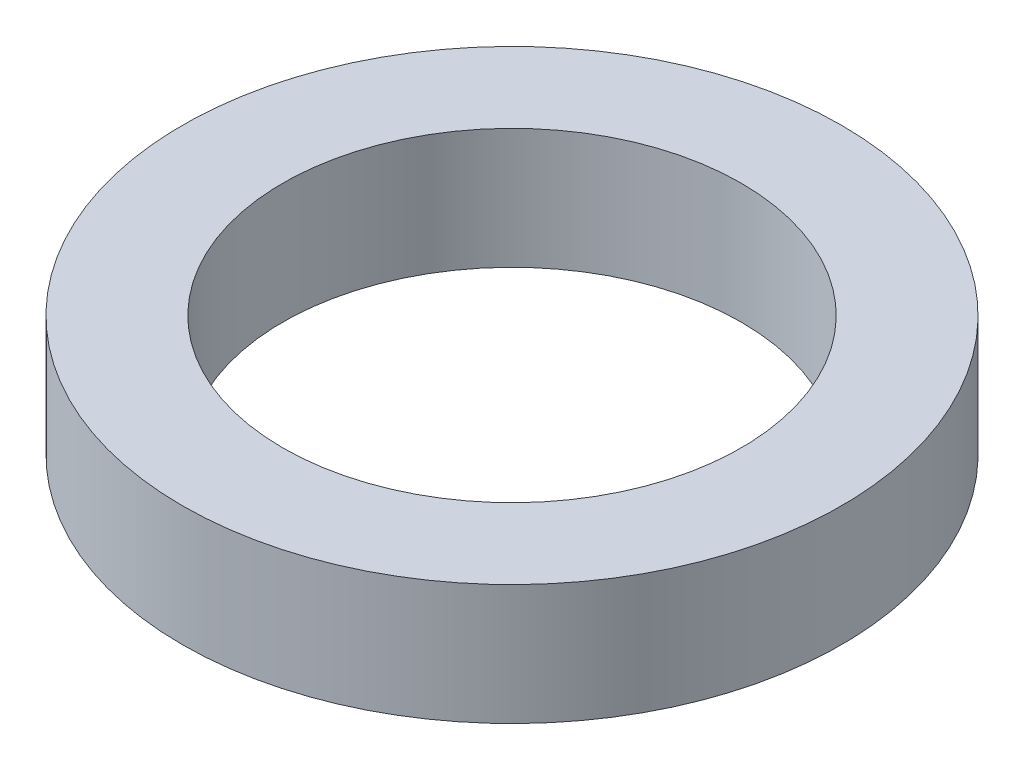
ISO-10303-21;
HEADER;
FILE_DESCRIPTION(('STEP AP214'),'2;1');
FILE_NAME('part.step','',(''),(''),'','','');
FILE_SCHEMA(('AUTOMOTIVE_DESIGN { 1 0 10303 214 1 1 1 1 }'));
ENDSEC;
DATA;
#1=APPLICATION_CONTEXT('core data for automotive mechanical design processes');
#2=APPLICATION_PROTOCOL_DEFINITION('international standard','automotive_design',2000,#1);
#3=PRODUCT_CONTEXT('',#1,'mechanical');
#4=PRODUCT('Part','Part','',(#3));
#5=PRODUCT_RELATED_PRODUCT_CATEGORY('part','',(#4));
#6=PRODUCT_DEFINITION_FORMATION('','',#4);
#7=PRODUCT_DEFINITION_CONTEXT('part definition',#1,'design');
#8=PRODUCT_DEFINITION('design','',#6,#7);
#9=PRODUCT_DEFINITION_SHAPE('','',#8);
#10=(LENGTH_UNIT() NAMED_UNIT(*) SI_UNIT(.MILLI.,.METRE.));
#11=(NAMED_UNIT(*) PLANE_ANGLE_UNIT() SI_UNIT($,.RADIAN.));
#12=(NAMED_UNIT(*) SI_UNIT($,.STERADIAN.) SOLID_ANGLE_UNIT());
#13=UNCERTAINTY_MEASURE_WITH_UNIT(LENGTH_MEASURE(1.E-05),#10,'distance_accuracy_value','');
#14=(GEOMETRIC_REPRESENTATION_CONTEXT(3) GLOBAL_UNCERTAINTY_ASSIGNED_CONTEXT((#13)) GLOBAL_UNIT_ASSIGNED_CONTEXT((#10,
#11,#12)) REPRESENTATION_CONTEXT('',''));
#15=CARTESIAN_POINT('',(0.,0.,0.));
#16=DIRECTION('',(0.,0.,1.));
#17=DIRECTION('',(1.,0.,0.));
#18=AXIS2_PLACEMENT_3D('',#15,#16,#17);
#19=CARTESIAN_POINT('',(0.,21.,0.));
#20=DIRECTION('',(0.,-1.,0.));
#21=DIRECTION('',(0.,0.,-1.));
#22=AXIS2_PLACEMENT_3D('',#19,#20,#21);
#23=CYLINDRICAL_SURFACE('',#22,57.5);
#24=CARTESIAN_POINT('',(0.,21.,0.));
#25=DIRECTION('',(0.,1.,0.));
#26=DIRECTION('',(0.,0.,1.));
#27=AXIS2_PLACEMENT_3D('',#24,#25,#26);
#28=CIRCLE('',#27,57.5);
#29=CARTESIAN_POINT('',(0.,21.,-57.5));
#30=VERTEX_POINT('',#29);
#31=EDGE_CURVE('E10',#30,#30,#28,.T.);
#32=CARTESIAN_POINT('',(0.,0.,0.));
#33=DIRECTION('',(0.,1.,0.));
#34=DIRECTION('',(0.,0.,1.));
#35=AXIS2_PLACEMENT_3D('',#32,#33,#34);
#36=CIRCLE('',#35,57.5);
#37=CARTESIAN_POINT('',(0.,0.,-57.5));
#38=VERTEX_POINT('',#37);
#39=EDGE_CURVE('E37',#38,#38,#36,.T.);
#40=CARTESIAN_POINT('',(0.,21.,-57.5));
#41=CARTESIAN_POINT('',(0.,20.78125,-57.5));
#42=CARTESIAN_POINT('',(0.,20.5625,-57.5));
#43=CARTESIAN_POINT('',(0.,20.125,-57.5));
#44=CARTESIAN_POINT('',(0.,19.90625,-57.5));
#45=CARTESIAN_POINT('',(0.,19.46875,-57.5));
#46=CARTESIAN_POINT('',(0.,19.25,-57.5));
#47=CARTESIAN_POINT('',(0.,18.8125,-57.5));
#48=CARTESIAN_POINT('',(0.,18.59375,-57.5));
#49=CARTESIAN_POINT('',(0.,18.15625,-57.5));
#50=CARTESIAN_POINT('',(0.,17.9375,-57.5));
#51=CARTESIAN_POINT('',(0.,17.5,-57.5));
#52=CARTESIAN_POINT('',(0.,17.28125,-57.5));
#53=CARTESIAN_POINT('',(0.,16.84375,-57.5));
#54=CARTESIAN_POINT('',(0.,16.625,-57.5));
#55=CARTESIAN_POINT('',(0.,16.1875,-57.5));
#56=CARTESIAN_POINT('',(0.,15.96875,-57.5));
#57=CARTESIAN_POINT('',(0.,15.53125,-57.5));
#58=CARTESIAN_POINT('',(0.,15.3125,-57.5));
#59=CARTESIAN_POINT('',(0.,14.875,-57.5));
#60=CARTESIAN_POINT('',(0.,14.65625,-57.5));
#61=CARTESIAN_POINT('',(0.,14.21875,-57.5));
#62=CARTESIAN_POINT('',(0.,14.,-57.5));
#63=CARTESIAN_POINT('',(0.,13.5625,-57.5));
#64=CARTESIAN_POINT('',(0.,13.34375,-57.5));
#65=CARTESIAN_POINT('',(0.,12.90625,-57.5));
#66=CARTESIAN_POINT('',(0.,12.6875,-57.5));
#67=CARTESIAN_POINT('',(0.,12.25,-57.5));
#68=CARTESIAN_POINT('',(0.,12.03125,-57.5));
#69=CARTESIAN_POINT('',(0.,11.59375,-57.5));
#70=CARTESIAN_POINT('',(0.,11.375,-57.5));
#71=CARTESIAN_POINT('',(0.,10.9375,-57.5));
#72=CARTESIAN_POINT('',(0.,10.71875,-57.5));
#73=CARTESIAN_POINT('',(0.,10.28125,-57.5));
#74=CARTESIAN_POINT('',(0.,10.0625,-57.5));
#75=CARTESIAN_POINT('',(0.,9.625,-57.5));
#76=CARTESIAN_POINT('',(0.,9.40625,-57.5));
#77=CARTESIAN_POINT('',(0.,8.96875,-57.5));
#78=CARTESIAN_POINT('',(0.,8.75,-57.5));
#79=CARTESIAN_POINT('',(0.,8.3125,-57.5));
#80=CARTESIAN_POINT('',(0.,8.09375,-57.5));
#81=CARTESIAN_POINT('',(0.,7.65625,-57.5));
#82=CARTESIAN_POINT('',(0.,7.4375,-57.5));
#83=CARTESIAN_POINT('',(0.,7.,-57.5));
#84=CARTESIAN_POINT('',(0.,6.78125,-57.5));
#85=CARTESIAN_POINT('',(0.,6.34375,-57.5));
#86=CARTESIAN_POINT('',(0.,6.125,-57.5));
#87=CARTESIAN_POINT('',(0.,5.6875,-57.5));
#88=CARTESIAN_POINT('',(0.,5.46875,-57.5));
#89=CARTESIAN_POINT('',(0.,5.03125,-57.5));
#90=CARTESIAN_POINT('',(0.,4.8125,-57.5));
#91=CARTESIAN_POINT('',(0.,4.375,-57.5));
#92=CARTESIAN_POINT('',(0.,4.15625,-57.5));
#93=CARTESIAN_POINT('',(0.,3.71875,-57.5));
#94=CARTESIAN_POINT('',(0.,3.5,-57.5));
#95=CARTESIAN_POINT('',(0.,3.0625,-57.5));
#96=CARTESIAN_POINT('',(0.,2.84375,-57.5));
#97=CARTESIAN_POINT('',(0.,2.40625,-57.5));
#98=CARTESIAN_POINT('',(0.,2.1875,-57.5));
#99=CARTESIAN_POINT('',(0.,1.75,-57.5));
#100=CARTESIAN_POINT('',(0.,1.53125,-57.5));
#101=CARTESIAN_POINT('',(0.,1.09375,-57.5));
#102=CARTESIAN_POINT('',(0.,0.875000000000001,-57.5));
#103=CARTESIAN_POINT('',(0.,0.4375,-57.5));
#104=CARTESIAN_POINT('',(0.,0.21875,-57.5));
#105=CARTESIAN_POINT('',(0.,0.,-57.5));
#106=B_SPLINE_CURVE_WITH_KNOTS('',3,(#40,#41,#42,#43,#44,#45,#46,#47,#48,#49,#50,#51,#52,#53,
#54,#55,#56,#57,#58,#59,#60,#61,#62,#63,#64,#65,#66,#67,#68,#69,#70,#71,#72,#73,#74,#75,#76,#77,
#78,#79,#80,#81,#82,#83,#84,#85,#86,#87,#88,#89,#90,#91,#92,#93,#94,#95,#96,#97,#98,#99,#100,
#101,#102,#103,#104,#105),.UNSPECIFIED.,.F.,.F.,(4,2,2,2,2,2,2,2,2,2,2,2,2,2,2,2,2,2,2,2,2,2,2,
2,2,2,2,2,2,2,2,2,4),(0.,0.656250000000001,1.3125,1.96875,2.625,3.28125,3.9375,4.59375,5.25,
5.90625,6.5625,7.21875,7.875,8.53125,9.1875,9.84375,10.5,11.15625,11.8125,12.46875,13.125,
13.78125,14.4375,15.09375,15.75,16.40625,17.0625,17.71875,18.375,19.03125,19.6875,20.34375,21.),.UNSPECIFIED.);
#107=EDGE_CURVE('BSEAM40',#30,#38,#106,.T.);
#108=ORIENTED_EDGE('',*,*,#31,.F.);
#109=ORIENTED_EDGE('',*,*,#39,.T.);
#110=ORIENTED_EDGE('',*,*,#107,.T.);
#111=ORIENTED_EDGE('',*,*,#107,.F.);
#112=EDGE_LOOP('',(#108,#110,#109,#111));
#113=FACE_BOUND('',#112,.T.);
#114=ADVANCED_FACE('F40',(#113),#23,.T.);
#115=CARTESIAN_POINT('',(0.,21.,0.));
#116=DIRECTION('',(0.,1.,0.));
#117=DIRECTION('',(0.,0.,1.));
#118=AXIS2_PLACEMENT_3D('',#115,#116,#117);
#119=PLANE('',#118);
#120=CARTESIAN_POINT('',(0.,21.,0.));
#121=DIRECTION('',(0.,1.,0.));
#122=DIRECTION('',(0.,0.,1.));
#123=AXIS2_PLACEMENT_3D('',#120,#121,#122);
#124=CIRCLE('',#123,40.);
#125=CARTESIAN_POINT('',(0.,21.,-40.));
#126=VERTEX_POINT('',#125);
#127=EDGE_CURVE('E50',#126,#126,#124,.T.);
#128=ORIENTED_EDGE('',*,*,#127,.F.);
#129=EDGE_LOOP('',(#128));
#130=FACE_BOUND('',#129,.T.);
#131=ORIENTED_EDGE('',*,*,#31,.T.);
#132=EDGE_LOOP('',(#131));
#133=FACE_BOUND('',#132,.T.);
#134=ADVANCED_FACE('F59',(#130,#133),#119,.T.);
#135=CARTESIAN_POINT('',(0.,0.,0.));
#136=DIRECTION('',(0.,1.,0.));
#137=DIRECTION('',(0.,0.,1.));
#138=AXIS2_PLACEMENT_3D('',#135,#136,#137);
#139=PLANE('',#138);
#140=CARTESIAN_POINT('',(0.,0.,0.));
#141=DIRECTION('',(0.,1.,0.));
#142=DIRECTION('',(0.,0.,1.));
#143=AXIS2_PLACEMENT_3D('',#140,#141,#142);
#144=CIRCLE('',#143,40.);
#145=CARTESIAN_POINT('',(0.,0.,-40.));
#146=VERTEX_POINT('',#145);
#147=EDGE_CURVE('E47',#146,#146,#144,.T.);
#148=ORIENTED_EDGE('',*,*,#147,.T.);
#149=EDGE_LOOP('',(#148));
#150=FACE_BOUND('',#149,.T.);
#151=ORIENTED_EDGE('',*,*,#39,.F.);
#152=EDGE_LOOP('',(#151));
#153=FACE_BOUND('',#152,.T.);
#154=ADVANCED_FACE('F58',(#150,#153),#139,.F.);
#155=CARTESIAN_POINT('',(0.,21.,0.));
#156=DIRECTION('',(0.,-1.,0.));
#157=DIRECTION('',(0.,0.,-1.));
#158=AXIS2_PLACEMENT_3D('',#155,#156,#157);
#159=CYLINDRICAL_SURFACE('',#158,40.);
#160=CARTESIAN_POINT('',(0.,21.,-40.));
#161=CARTESIAN_POINT('',(0.,20.78125,-40.));
#162=CARTESIAN_POINT('',(0.,20.5625,-40.));
#163=CARTESIAN_POINT('',(0.,20.125,-40.));
#164=CARTESIAN_POINT('',(0.,19.90625,-40.));
#165=CARTESIAN_POINT('',(0.,19.46875,-40.));
#166=CARTESIAN_POINT('',(0.,19.25,-40.));
#167=CARTESIAN_POINT('',(0.,18.8125,-40.));
#168=CARTESIAN_POINT('',(0.,18.59375,-40.));
#169=CARTESIAN_POINT('',(0.,18.15625,-40.));
#170=CARTESIAN_POINT('',(0.,17.9375,-40.));
#171=CARTESIAN_POINT('',(0.,17.5,-40.));
#172=CARTESIAN_POINT('',(0.,17.28125,-40.));
#173=CARTESIAN_POINT('',(0.,16.84375,-40.));
#174=CARTESIAN_POINT('',(0.,16.625,-40.));
#175=CARTESIAN_POINT('',(0.,16.1875,-40.));
#176=CARTESIAN_POINT('',(0.,15.96875,-40.));
#177=CARTESIAN_POINT('',(0.,15.53125,-40.));
#178=CARTESIAN_POINT('',(0.,15.3125,-40.));
#179=CARTESIAN_POINT('',(0.,14.875,-40.));
#180=CARTESIAN_POINT('',(0.,14.65625,-40.));
#181=CARTESIAN_POINT('',(0.,14.21875,-40.));
#182=CARTESIAN_POINT('',(0.,14.,-40.));
#183=CARTESIAN_POINT('',(0.,13.5625,-40.));
#184=CARTESIAN_POINT('',(0.,13.34375,-40.));
#185=CARTESIAN_POINT('',(0.,12.90625,-40.));
#186=CARTESIAN_POINT('',(0.,12.6875,-40.));
#187=CARTESIAN_POINT('',(0.,12.25,-40.));
#188=CARTESIAN_POINT('',(0.,12.03125,-40.));
#189=CARTESIAN_POINT('',(0.,11.59375,-40.));
#190=CARTESIAN_POINT('',(0.,11.375,-40.));
#191=CARTESIAN_POINT('',(0.,10.9375,-40.));
#192=CARTESIAN_POINT('',(0.,10.71875,-40.));
#193=CARTESIAN_POINT('',(0.,10.28125,-40.));
#194=CARTESIAN_POINT('',(0.,10.0625,-40.));
#195=CARTESIAN_POINT('',(0.,9.625,-40.));
#196=CARTESIAN_POINT('',(0.,9.40625,-40.));
#197=CARTESIAN_POINT('',(0.,8.96875,-40.));
#198=CARTESIAN_POINT('',(0.,8.75,-40.));
#199=CARTESIAN_POINT('',(0.,8.3125,-40.));
#200=CARTESIAN_POINT('',(0.,8.09375,-40.));
#201=CARTESIAN_POINT('',(0.,7.65625,-40.));
#202=CARTESIAN_POINT('',(0.,7.4375,-40.));
#203=CARTESIAN_POINT('',(0.,7.,-40.));
#204=CARTESIAN_POINT('',(0.,6.78125,-40.));
#205=CARTESIAN_POINT('',(0.,6.34375,-40.));
#206=CARTESIAN_POINT('',(0.,6.125,-40.));
#207=CARTESIAN_POINT('',(0.,5.6875,-40.));
#208=CARTESIAN_POINT('',(0.,5.46875,-40.));
#209=CARTESIAN_POINT('',(0.,5.03125,-40.));
#210=CARTESIAN_POINT('',(0.,4.8125,-40.));
#211=CARTESIAN_POINT('',(0.,4.375,-40.));
#212=CARTESIAN_POINT('',(0.,4.15625,-40.));
#213=CARTESIAN_POINT('',(0.,3.71875,-40.));
#214=CARTESIAN_POINT('',(0.,3.5,-40.));
#215=CARTESIAN_POINT('',(0.,3.0625,-40.));
#216=CARTESIAN_POINT('',(0.,2.84375,-40.));
#217=CARTESIAN_POINT('',(0.,2.40625,-40.));
#218=CARTESIAN_POINT('',(0.,2.1875,-40.));
#219=CARTESIAN_POINT('',(0.,1.75,-40.));
#220=CARTESIAN_POINT('',(0.,1.53125,-40.));
#221=CARTESIAN_POINT('',(0.,1.09375,-40.));
#222=CARTESIAN_POINT('',(0.,0.875000000000001,-40.));
#223=CARTESIAN_POINT('',(0.,0.4375,-40.));
#224=CARTESIAN_POINT('',(0.,0.21875,-40.));
#225=CARTESIAN_POINT('',(0.,0.,-40.));
#226=B_SPLINE_CURVE_WITH_KNOTS('',3,(#160,#161,#162,#163,#164,#165,#166,#167,#168,#169,#170,
#171,#172,#173,#174,#175,#176,#177,#178,#179,#180,#181,#182,#183,#184,#185,#186,#187,#188,#189,
#190,#191,#192,#193,#194,#195,#196,#197,#198,#199,#200,#201,#202,#203,#204,#205,#206,#207,#208,
#209,#210,#211,#212,#213,#214,#215,#216,#217,#218,#219,#220,#221,#222,#223,#224,#225),
.UNSPECIFIED.,.F.,.F.,(4,2,2,2,2,2,2,2,2,2,2,2,2,2,2,2,2,2,2,2,2,2,2,2,2,2,2,2,2,2,2,2,4),(0.,
0.656249999999997,1.3125,1.96875,2.625,3.28125,3.9375,4.59375,5.25,5.90625,6.5625,7.21875,7.875,
8.53125,9.1875,9.84375,10.5,11.15625,11.8125,12.46875,13.125,13.78125,14.4375,15.09375,15.75,
16.40625,17.0625,17.71875,18.375,19.03125,19.6875,20.34375,21.),.UNSPECIFIED.);
#227=EDGE_CURVE('BSEAM54',#126,#146,#226,.T.);
#228=ORIENTED_EDGE('',*,*,#127,.T.);
#229=ORIENTED_EDGE('',*,*,#147,.F.);
#230=ORIENTED_EDGE('',*,*,#227,.T.);
#231=ORIENTED_EDGE('',*,*,#227,.F.);
#232=EDGE_LOOP('',(#228,#230,#229,#231));
#233=FACE_BOUND('',#232,.T.);
#234=ADVANCED_FACE('F54',(#233),#159,.F.);
#235=CLOSED_SHELL('',(#114,#134,#154,#234));
#236=MANIFOLD_SOLID_BREP('B2',#235);
#237=ADVANCED_BREP_SHAPE_REPRESENTATION('',(#18,#236),#14);
#238=SHAPE_DEFINITION_REPRESENTATION(#9,#237);
ENDSEC;
END-ISO-10303-21;
